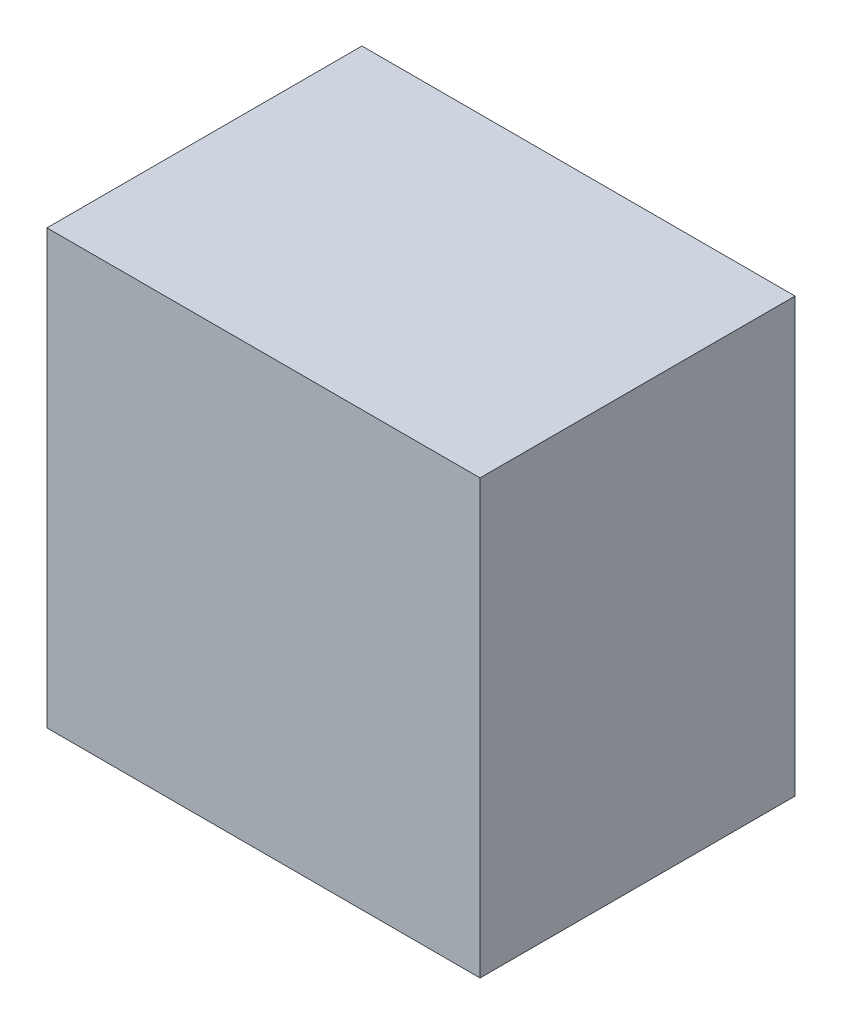
ISO-10303-21;
HEADER;
FILE_DESCRIPTION(('STEP AP214'),'2;1');
FILE_NAME('part.step','',(''),(''),'','','');
FILE_SCHEMA(('AUTOMOTIVE_DESIGN { 1 0 10303 214 1 1 1 1 }'));
ENDSEC;
DATA;
#1=APPLICATION_CONTEXT('core data for automotive mechanical design processes');
#2=APPLICATION_PROTOCOL_DEFINITION('international standard','automotive_design',2000,#1);
#3=PRODUCT_CONTEXT('',#1,'mechanical');
#4=PRODUCT('Part','Part','',(#3));
#5=PRODUCT_RELATED_PRODUCT_CATEGORY('part','',(#4));
#6=PRODUCT_DEFINITION_FORMATION('','',#4);
#7=PRODUCT_DEFINITION_CONTEXT('part definition',#1,'design');
#8=PRODUCT_DEFINITION('design','',#6,#7);
#9=PRODUCT_DEFINITION_SHAPE('','',#8);
#10=(LENGTH_UNIT() NAMED_UNIT(*) SI_UNIT(.MILLI.,.METRE.));
#11=(NAMED_UNIT(*) PLANE_ANGLE_UNIT() SI_UNIT($,.RADIAN.));
#12=(NAMED_UNIT(*) SI_UNIT($,.STERADIAN.) SOLID_ANGLE_UNIT());
#13=UNCERTAINTY_MEASURE_WITH_UNIT(LENGTH_MEASURE(1.E-05),#10,'distance_accuracy_value','');
#14=(GEOMETRIC_REPRESENTATION_CONTEXT(3) GLOBAL_UNCERTAINTY_ASSIGNED_CONTEXT((#13)) GLOBAL_UNIT_ASSIGNED_CONTEXT((#10,
#11,#12)) REPRESENTATION_CONTEXT('',''));
#15=CARTESIAN_POINT('',(0.,0.,0.));
#16=DIRECTION('',(0.,0.,1.));
#17=DIRECTION('',(1.,0.,0.));
#18=AXIS2_PLACEMENT_3D('',#15,#16,#17);
#19=CARTESIAN_POINT('',(0.27500072,-0.27500072,0.));
#20=DIRECTION('',(0.,-1.,0.));
#21=DIRECTION('',(-1.,0.,0.));
#22=AXIS2_PLACEMENT_3D('',#19,#20,#21);
#23=PLANE('',#22);
#24=DIRECTION('',(0.,0.,1.));
#25=VECTOR('',#24,1.);
#26=CARTESIAN_POINT('',(0.27500072,-0.27500072,0.));
#27=LINE('',#26,#25);
#28=CARTESIAN_POINT('',(0.27500072,-0.27500072,0.));
#29=VERTEX_POINT('',#28);
#30=CARTESIAN_POINT('',(0.27500072,-0.27500072,0.3999992));
#31=VERTEX_POINT('',#30);
#32=EDGE_CURVE('E11',#29,#31,#27,.T.);
#33=ORIENTED_EDGE('',*,*,#32,.T.);
#34=DIRECTION('',(-1.,0.,0.));
#35=VECTOR('',#34,1.);
#36=CARTESIAN_POINT('',(0.27500072,-0.27500072,0.3999992));
#37=LINE('',#36,#35);
#38=CARTESIAN_POINT('',(-0.27499818,-0.27500072,0.3999992));
#39=VERTEX_POINT('',#38);
#40=EDGE_CURVE('E24',#31,#39,#37,.T.);
#41=ORIENTED_EDGE('',*,*,#40,.T.);
#42=DIRECTION('',(0.,0.,1.));
#43=VECTOR('',#42,1.);
#44=CARTESIAN_POINT('',(-0.27499818,-0.27500072,0.));
#45=LINE('',#44,#43);
#46=CARTESIAN_POINT('',(-0.27499818,-0.27500072,0.));
#47=VERTEX_POINT('',#46);
#48=EDGE_CURVE('E85',#47,#39,#45,.T.);
#49=ORIENTED_EDGE('',*,*,#48,.F.);
#50=DIRECTION('',(-1.,0.,0.));
#51=VECTOR('',#50,1.);
#52=CARTESIAN_POINT('',(0.27500072,-0.27500072,0.));
#53=LINE('',#52,#51);
#54=EDGE_CURVE('E83',#29,#47,#53,.T.);
#55=ORIENTED_EDGE('',*,*,#54,.F.);
#56=EDGE_LOOP('',(#33,#41,#49,#55));
#57=FACE_BOUND('',#56,.T.);
#58=ADVANCED_FACE('F17',(#57),#23,.T.);
#59=CARTESIAN_POINT('',(-0.27499818,-0.27500072,0.));
#60=DIRECTION('',(-1.,0.,0.));
#61=DIRECTION('',(0.,1.,0.));
#62=AXIS2_PLACEMENT_3D('',#59,#60,#61);
#63=PLANE('',#62);
#64=ORIENTED_EDGE('',*,*,#48,.T.);
#65=DIRECTION('',(0.,1.,0.));
#66=VECTOR('',#65,1.);
#67=CARTESIAN_POINT('',(-0.27499818,-0.27500072,0.3999992));
#68=LINE('',#67,#66);
#69=CARTESIAN_POINT('',(-0.27499818,0.27500072,0.3999992));
#70=VERTEX_POINT('',#69);
#71=EDGE_CURVE('E81',#39,#70,#68,.T.);
#72=ORIENTED_EDGE('',*,*,#71,.T.);
#73=DIRECTION('',(0.,0.,1.));
#74=VECTOR('',#73,1.);
#75=CARTESIAN_POINT('',(-0.27499818,0.27500072,0.));
#76=LINE('',#75,#74);
#77=CARTESIAN_POINT('',(-0.27499818,0.27500072,0.));
#78=VERTEX_POINT('',#77);
#79=EDGE_CURVE('E79',#78,#70,#76,.T.);
#80=ORIENTED_EDGE('',*,*,#79,.F.);
#81=DIRECTION('',(0.,1.,0.));
#82=VECTOR('',#81,1.);
#83=CARTESIAN_POINT('',(-0.27499818,-0.27500072,0.));
#84=LINE('',#83,#82);
#85=EDGE_CURVE('E70',#47,#78,#84,.T.);
#86=ORIENTED_EDGE('',*,*,#85,.F.);
#87=EDGE_LOOP('',(#64,#72,#80,#86));
#88=FACE_BOUND('',#87,.T.);
#89=ADVANCED_FACE('F90',(#88),#63,.T.);
#90=CARTESIAN_POINT('',(-0.27499818,0.27500072,0.));
#91=DIRECTION('',(0.,1.,0.));
#92=DIRECTION('',(1.,0.,0.));
#93=AXIS2_PLACEMENT_3D('',#90,#91,#92);
#94=PLANE('',#93);
#95=ORIENTED_EDGE('',*,*,#79,.T.);
#96=DIRECTION('',(1.,0.,0.));
#97=VECTOR('',#96,1.);
#98=CARTESIAN_POINT('',(-0.27499818,0.27500072,0.3999992));
#99=LINE('',#98,#97);
#100=CARTESIAN_POINT('',(0.27500072,0.27500072,0.3999992));
#101=VERTEX_POINT('',#100);
#102=EDGE_CURVE('E60',#70,#101,#99,.T.);
#103=ORIENTED_EDGE('',*,*,#102,.T.);
#104=DIRECTION('',(0.,0.,1.));
#105=VECTOR('',#104,1.);
#106=CARTESIAN_POINT('',(0.27500072,0.27500072,0.));
#107=LINE('',#106,#105);
#108=CARTESIAN_POINT('',(0.27500072,0.27500072,0.));
#109=VERTEX_POINT('',#108);
#110=EDGE_CURVE('E54',#109,#101,#107,.T.);
#111=ORIENTED_EDGE('',*,*,#110,.F.);
#112=DIRECTION('',(1.,0.,0.));
#113=VECTOR('',#112,1.);
#114=CARTESIAN_POINT('',(-0.27499818,0.27500072,0.));
#115=LINE('',#114,#113);
#116=EDGE_CURVE('E58',#78,#109,#115,.T.);
#117=ORIENTED_EDGE('',*,*,#116,.F.);
#118=EDGE_LOOP('',(#95,#103,#111,#117));
#119=FACE_BOUND('',#118,.T.);
#120=ADVANCED_FACE('F57',(#119),#94,.T.);
#121=CARTESIAN_POINT('',(0.27500072,0.27500072,0.));
#122=DIRECTION('',(1.,0.,0.));
#123=DIRECTION('',(0.,-1.,0.));
#124=AXIS2_PLACEMENT_3D('',#121,#122,#123);
#125=PLANE('',#124);
#126=ORIENTED_EDGE('',*,*,#110,.T.);
#127=DIRECTION('',(0.,-1.,0.));
#128=VECTOR('',#127,1.);
#129=CARTESIAN_POINT('',(0.27500072,0.27500072,0.3999992));
#130=LINE('',#129,#128);
#131=EDGE_CURVE('E71',#101,#31,#130,.T.);
#132=ORIENTED_EDGE('',*,*,#131,.T.);
#133=ORIENTED_EDGE('',*,*,#32,.F.);
#134=DIRECTION('',(0.,-1.,0.));
#135=VECTOR('',#134,1.);
#136=CARTESIAN_POINT('',(0.27500072,0.27500072,0.));
#137=LINE('',#136,#135);
#138=EDGE_CURVE('E68',#109,#29,#137,.T.);
#139=ORIENTED_EDGE('',*,*,#138,.F.);
#140=EDGE_LOOP('',(#126,#132,#133,#139));
#141=FACE_BOUND('',#140,.T.);
#142=ADVANCED_FACE('F73',(#141),#125,.T.);
#143=CARTESIAN_POINT('',(1.270000000272E-06,0.,0.));
#144=DIRECTION('',(0.,0.,-1.));
#145=DIRECTION('',(-1.,0.,0.));
#146=AXIS2_PLACEMENT_3D('',#143,#144,#145);
#147=PLANE('',#146);
#148=ORIENTED_EDGE('',*,*,#54,.T.);
#149=ORIENTED_EDGE('',*,*,#85,.T.);
#150=ORIENTED_EDGE('',*,*,#116,.T.);
#151=ORIENTED_EDGE('',*,*,#138,.T.);
#152=EDGE_LOOP('',(#148,#149,#150,#151));
#153=FACE_BOUND('',#152,.T.);
#154=ADVANCED_FACE('F67',(#153),#147,.T.);
#155=CARTESIAN_POINT('',(1.270000000272E-06,0.,0.3999992));
#156=DIRECTION('',(0.,0.,-1.));
#157=DIRECTION('',(-1.,0.,0.));
#158=AXIS2_PLACEMENT_3D('',#155,#156,#157);
#159=PLANE('',#158);
#160=ORIENTED_EDGE('',*,*,#131,.F.);
#161=ORIENTED_EDGE('',*,*,#102,.F.);
#162=ORIENTED_EDGE('',*,*,#71,.F.);
#163=ORIENTED_EDGE('',*,*,#40,.F.);
#164=EDGE_LOOP('',(#160,#161,#162,#163));
#165=FACE_BOUND('',#164,.T.);
#166=ADVANCED_FACE('F91',(#165),#159,.F.);
#167=CLOSED_SHELL('',(#58,#89,#120,#142,#154,#166));
#168=MANIFOLD_SOLID_BREP('B1',#167);
#169=ADVANCED_BREP_SHAPE_REPRESENTATION('',(#18,#168),#14);
#170=SHAPE_DEFINITION_REPRESENTATION(#9,#169);
ENDSEC;
END-ISO-10303-21;
